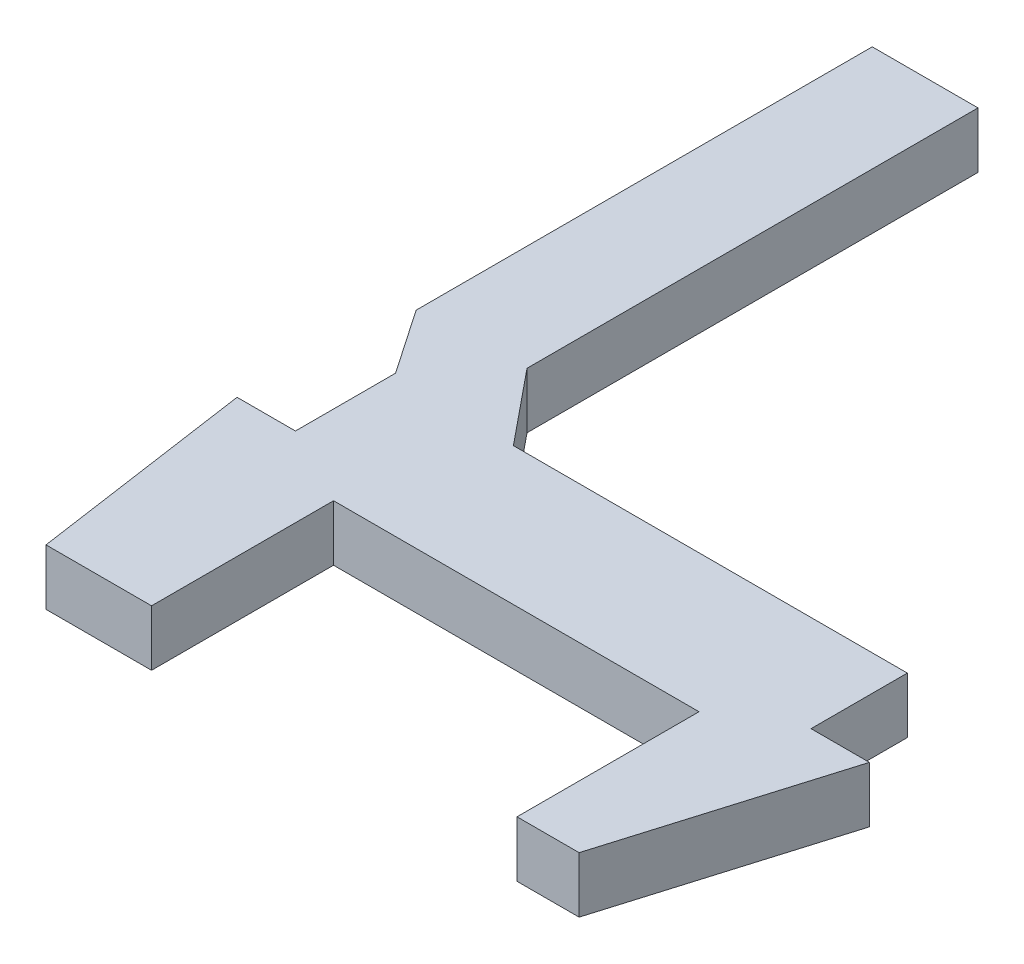
ISO-10303-21;
HEADER;
FILE_DESCRIPTION(('STEP AP214'),'2;1');
FILE_NAME('part.step','',(''),(''),'','','');
FILE_SCHEMA(('AUTOMOTIVE_DESIGN { 1 0 10303 214 1 1 1 1 }'));
ENDSEC;
DATA;
#1=APPLICATION_CONTEXT('core data for automotive mechanical design processes');
#2=APPLICATION_PROTOCOL_DEFINITION('international standard','automotive_design',2000,#1);
#3=PRODUCT_CONTEXT('',#1,'mechanical');
#4=PRODUCT('Part','Part','',(#3));
#5=PRODUCT_RELATED_PRODUCT_CATEGORY('part','',(#4));
#6=PRODUCT_DEFINITION_FORMATION('','',#4);
#7=PRODUCT_DEFINITION_CONTEXT('part definition',#1,'design');
#8=PRODUCT_DEFINITION('design','',#6,#7);
#9=PRODUCT_DEFINITION_SHAPE('','',#8);
#10=(LENGTH_UNIT() NAMED_UNIT(*) SI_UNIT(.MILLI.,.METRE.));
#11=(NAMED_UNIT(*) PLANE_ANGLE_UNIT() SI_UNIT($,.RADIAN.));
#12=(NAMED_UNIT(*) SI_UNIT($,.STERADIAN.) SOLID_ANGLE_UNIT());
#13=UNCERTAINTY_MEASURE_WITH_UNIT(LENGTH_MEASURE(1.E-05),#10,'distance_accuracy_value','');
#14=(GEOMETRIC_REPRESENTATION_CONTEXT(3) GLOBAL_UNCERTAINTY_ASSIGNED_CONTEXT((#13)) GLOBAL_UNIT_ASSIGNED_CONTEXT((#10,
#11,#12)) REPRESENTATION_CONTEXT('',''));
#15=CARTESIAN_POINT('',(0.,0.,0.));
#16=DIRECTION('',(0.,0.,1.));
#17=DIRECTION('',(1.,0.,0.));
#18=AXIS2_PLACEMENT_3D('',#15,#16,#17);
#19=CARTESIAN_POINT('',(-3.887220045903,-0.225,1.053796595231));
#20=DIRECTION('',(0.,-1.,0.));
#21=DIRECTION('',(0.,0.,-1.));
#22=AXIS2_PLACEMENT_3D('',#19,#20,#21);
#23=PLANE('',#22);
#24=DIRECTION('',(0.,0.,-1.));
#25=VECTOR('',#24,1.);
#26=CARTESIAN_POINT('',(-5.633558,-0.225,0.573115));
#27=LINE('',#26,#25);
#28=CARTESIAN_POINT('',(-5.633558,-0.225,0.573115));
#29=VERTEX_POINT('',#28);
#30=CARTESIAN_POINT('',(-5.633558,-0.225,-3.1));
#31=VERTEX_POINT('',#30);
#32=EDGE_CURVE('E212',#29,#31,#27,.T.);
#33=ORIENTED_EDGE('',*,*,#32,.T.);
#34=DIRECTION('',(1.,0.,0.));
#35=VECTOR('',#34,1.);
#36=CARTESIAN_POINT('',(-5.633558,-0.225,-3.1));
#37=LINE('',#36,#35);
#38=CARTESIAN_POINT('',(-4.781852,-0.225,-3.1));
#39=VERTEX_POINT('',#38);
#40=EDGE_CURVE('E202',#31,#39,#37,.T.);
#41=ORIENTED_EDGE('',*,*,#40,.T.);
#42=DIRECTION('',(0.,0.,1.));
#43=VECTOR('',#42,1.);
#44=CARTESIAN_POINT('',(-4.781852,-0.225,-3.1));
#45=LINE('',#44,#43);
#46=CARTESIAN_POINT('',(-4.781852,-0.225,0.531664));
#47=VERTEX_POINT('',#46);
#48=EDGE_CURVE('E294',#39,#47,#45,.T.);
#49=ORIENTED_EDGE('',*,*,#48,.T.);
#50=DIRECTION('',(0.632051189116861,0.,0.774926638034829));
#51=VECTOR('',#50,1.);
#52=CARTESIAN_POINT('',(-4.781852,-0.225,0.531664));
#53=LINE('',#52,#51);
#54=CARTESIAN_POINT('',(-4.297031,-0.225,1.126079));
#55=VERTEX_POINT('',#54);
#56=EDGE_CURVE('E194',#47,#55,#53,.T.);
#57=ORIENTED_EDGE('',*,*,#56,.T.);
#58=DIRECTION('',(1.,0.,0.));
#59=VECTOR('',#58,1.);
#60=CARTESIAN_POINT('',(-4.297031,-0.225,1.126079));
#61=LINE('',#60,#59);
#62=CARTESIAN_POINT('',(-1.124856,-0.225,1.126079));
#63=VERTEX_POINT('',#62);
#64=EDGE_CURVE('E229',#55,#63,#61,.T.);
#65=ORIENTED_EDGE('',*,*,#64,.T.);
#66=DIRECTION('',(0.,0.,1.));
#67=VECTOR('',#66,1.);
#68=CARTESIAN_POINT('',(-1.124856,-0.225,1.126079));
#69=LINE('',#68,#67);
#70=CARTESIAN_POINT('',(-1.124856,-0.225,1.901539999995));
#71=VERTEX_POINT('',#70);
#72=EDGE_CURVE('E20',#63,#71,#69,.T.);
#73=ORIENTED_EDGE('',*,*,#72,.T.);
#74=DIRECTION('',(1.,0.,0.));
#75=VECTOR('',#74,1.);
#76=CARTESIAN_POINT('',(-1.124856,-0.225,1.901539999995));
#77=LINE('',#76,#75);
#78=CARTESIAN_POINT('',(-0.654846,-0.225,1.901539999995));
#79=VERTEX_POINT('',#78);
#80=EDGE_CURVE('E295',#71,#79,#77,.T.);
#81=ORIENTED_EDGE('',*,*,#80,.T.);
#82=DIRECTION('',(-0.287164642261005,0.,0.957881239108016));
#83=VECTOR('',#82,1.);
#84=CARTESIAN_POINT('',(-0.654846,-0.225,1.901539999995));
#85=LINE('',#84,#83);
#86=CARTESIAN_POINT('',(-1.194009,-0.225,3.7));
#87=VERTEX_POINT('',#86);
#88=EDGE_CURVE('E218',#79,#87,#85,.T.);
#89=ORIENTED_EDGE('',*,*,#88,.T.);
#90=DIRECTION('',(-1.,0.,0.));
#91=VECTOR('',#90,1.);
#92=CARTESIAN_POINT('',(-1.194009,-0.225,3.7));
#93=LINE('',#92,#91);
#94=CARTESIAN_POINT('',(-1.694009,-0.225,3.7));
#95=VERTEX_POINT('',#94);
#96=EDGE_CURVE('E256',#87,#95,#93,.T.);
#97=ORIENTED_EDGE('',*,*,#96,.T.);
#98=DIRECTION('',(0.,0.,-1.));
#99=VECTOR('',#98,1.);
#100=CARTESIAN_POINT('',(-1.694009,-0.225,3.7));
#101=LINE('',#100,#99);
#102=CARTESIAN_POINT('',(-1.694009,-0.225,2.234428));
#103=VERTEX_POINT('',#102);
#104=EDGE_CURVE('E236',#95,#103,#101,.T.);
#105=ORIENTED_EDGE('',*,*,#104,.T.);
#106=DIRECTION('',(-1.,0.,0.));
#107=VECTOR('',#106,1.);
#108=CARTESIAN_POINT('',(-1.694009,-0.225,2.234428));
#109=LINE('',#108,#107);
#110=CARTESIAN_POINT('',(-4.637080321881,-0.225,2.234428));
#111=VERTEX_POINT('',#110);
#112=EDGE_CURVE('E251',#103,#111,#109,.T.);
#113=ORIENTED_EDGE('',*,*,#112,.T.);
#114=DIRECTION('',(0.,0.,1.));
#115=VECTOR('',#114,1.);
#116=CARTESIAN_POINT('',(-4.637080321881,-0.225,2.234428));
#117=LINE('',#116,#115);
#118=CARTESIAN_POINT('',(-4.637080321881,-0.225,3.7));
#119=VERTEX_POINT('',#118);
#120=EDGE_CURVE('E246',#111,#119,#117,.T.);
#121=ORIENTED_EDGE('',*,*,#120,.T.);
#122=DIRECTION('',(-1.,0.,0.));
#123=VECTOR('',#122,1.);
#124=CARTESIAN_POINT('',(-4.637080321881,-0.225,3.7));
#125=LINE('',#124,#123);
#126=CARTESIAN_POINT('',(-5.487080321881,-0.225,3.7));
#127=VERTEX_POINT('',#126);
#128=EDGE_CURVE('E261',#119,#127,#125,.T.);
#129=ORIENTED_EDGE('',*,*,#128,.T.);
#130=DIRECTION('',(-0.142975922708004,0.,-0.989726166940025));
#131=VECTOR('',#130,1.);
#132=CARTESIAN_POINT('',(-5.487080321881,-0.225,3.7));
#133=LINE('',#132,#131);
#134=CARTESIAN_POINT('',(-5.746886,-0.225,1.901539999995));
#135=VERTEX_POINT('',#134);
#136=EDGE_CURVE('E173',#127,#135,#133,.T.);
#137=ORIENTED_EDGE('',*,*,#136,.T.);
#138=DIRECTION('',(1.,0.,0.));
#139=VECTOR('',#138,1.);
#140=CARTESIAN_POINT('',(-5.746886,-0.225,1.901539999995));
#141=LINE('',#140,#139);
#142=CARTESIAN_POINT('',(-5.276876,-0.225,1.901539999995));
#143=VERTEX_POINT('',#142);
#144=EDGE_CURVE('E169',#135,#143,#141,.T.);
#145=ORIENTED_EDGE('',*,*,#144,.T.);
#146=DIRECTION('',(0.,0.,-1.));
#147=VECTOR('',#146,1.);
#148=CARTESIAN_POINT('',(-5.276876,-0.225,1.901539999995));
#149=LINE('',#148,#147);
#150=CARTESIAN_POINT('',(-5.276876,-0.225,1.094923));
#151=VERTEX_POINT('',#150);
#152=EDGE_CURVE('E156',#143,#151,#149,.T.);
#153=ORIENTED_EDGE('',*,*,#152,.T.);
#154=DIRECTION('',(-0.564312586386218,0.,-0.825561205996319));
#155=VECTOR('',#154,1.);
#156=CARTESIAN_POINT('',(-5.276876,-0.225,1.094923));
#157=LINE('',#156,#155);
#158=EDGE_CURVE('E11',#151,#29,#157,.T.);
#159=ORIENTED_EDGE('',*,*,#158,.T.);
#160=EDGE_LOOP('',(#33,#41,#49,#57,#65,#73,#81,#89,#97,#105,#113,#121,#129,#137,#145,#153,#159));
#161=FACE_BOUND('',#160,.T.);
#162=ADVANCED_FACE('F16',(#161),#23,.T.);
#163=CARTESIAN_POINT('',(-3.887220045903,0.225,1.053796595231));
#164=DIRECTION('',(0.,-1.,0.));
#165=DIRECTION('',(0.,0.,-1.));
#166=AXIS2_PLACEMENT_3D('',#163,#164,#165);
#167=PLANE('',#166);
#168=DIRECTION('',(-0.564312586386218,0.,-0.825561205996319));
#169=VECTOR('',#168,1.);
#170=CARTESIAN_POINT('',(-5.276876,0.225,1.094923));
#171=LINE('',#170,#169);
#172=CARTESIAN_POINT('',(-5.276876,0.225,1.094923));
#173=VERTEX_POINT('',#172);
#174=CARTESIAN_POINT('',(-5.633558,0.225,0.573115));
#175=VERTEX_POINT('',#174);
#176=EDGE_CURVE('E27',#173,#175,#171,.T.);
#177=ORIENTED_EDGE('',*,*,#176,.F.);
#178=DIRECTION('',(0.,0.,-1.));
#179=VECTOR('',#178,1.);
#180=CARTESIAN_POINT('',(-5.276876,0.225,1.901539999995));
#181=LINE('',#180,#179);
#182=CARTESIAN_POINT('',(-5.276876,0.225,1.901539999995));
#183=VERTEX_POINT('',#182);
#184=EDGE_CURVE('E178',#183,#173,#181,.T.);
#185=ORIENTED_EDGE('',*,*,#184,.F.);
#186=DIRECTION('',(1.,0.,0.));
#187=VECTOR('',#186,1.);
#188=CARTESIAN_POINT('',(-5.746886,0.225,1.901539999995));
#189=LINE('',#188,#187);
#190=CARTESIAN_POINT('',(-5.746886,0.225,1.901539999995));
#191=VERTEX_POINT('',#190);
#192=EDGE_CURVE('E182',#191,#183,#189,.T.);
#193=ORIENTED_EDGE('',*,*,#192,.F.);
#194=DIRECTION('',(-0.142975922708004,0.,-0.989726166940025));
#195=VECTOR('',#194,1.);
#196=CARTESIAN_POINT('',(-5.487080321881,0.225,3.7));
#197=LINE('',#196,#195);
#198=CARTESIAN_POINT('',(-5.487080321881,0.225,3.7));
#199=VERTEX_POINT('',#198);
#200=EDGE_CURVE('E283',#199,#191,#197,.T.);
#201=ORIENTED_EDGE('',*,*,#200,.F.);
#202=DIRECTION('',(-1.,0.,0.));
#203=VECTOR('',#202,1.);
#204=CARTESIAN_POINT('',(-4.637080321881,0.225,3.7));
#205=LINE('',#204,#203);
#206=CARTESIAN_POINT('',(-4.637080321881,0.225,3.7));
#207=VERTEX_POINT('',#206);
#208=EDGE_CURVE('E262',#207,#199,#205,.T.);
#209=ORIENTED_EDGE('',*,*,#208,.F.);
#210=DIRECTION('',(0.,0.,1.));
#211=VECTOR('',#210,1.);
#212=CARTESIAN_POINT('',(-4.637080321881,0.225,2.234428));
#213=LINE('',#212,#211);
#214=CARTESIAN_POINT('',(-4.637080321881,0.225,2.234428));
#215=VERTEX_POINT('',#214);
#216=EDGE_CURVE('E247',#215,#207,#213,.T.);
#217=ORIENTED_EDGE('',*,*,#216,.F.);
#218=DIRECTION('',(-1.,0.,0.));
#219=VECTOR('',#218,1.);
#220=CARTESIAN_POINT('',(-1.694009,0.225,2.234428));
#221=LINE('',#220,#219);
#222=CARTESIAN_POINT('',(-1.694009,0.225,2.234428));
#223=VERTEX_POINT('',#222);
#224=EDGE_CURVE('E240',#223,#215,#221,.T.);
#225=ORIENTED_EDGE('',*,*,#224,.F.);
#226=DIRECTION('',(0.,0.,-1.));
#227=VECTOR('',#226,1.);
#228=CARTESIAN_POINT('',(-1.694009,0.225,3.7));
#229=LINE('',#228,#227);
#230=CARTESIAN_POINT('',(-1.694009,0.225,3.7));
#231=VERTEX_POINT('',#230);
#232=EDGE_CURVE('E252',#231,#223,#229,.T.);
#233=ORIENTED_EDGE('',*,*,#232,.F.);
#234=DIRECTION('',(-1.,0.,0.));
#235=VECTOR('',#234,1.);
#236=CARTESIAN_POINT('',(-1.194009,0.225,3.7));
#237=LINE('',#236,#235);
#238=CARTESIAN_POINT('',(-1.194009,0.225,3.7));
#239=VERTEX_POINT('',#238);
#240=EDGE_CURVE('E276',#239,#231,#237,.T.);
#241=ORIENTED_EDGE('',*,*,#240,.F.);
#242=DIRECTION('',(-0.287164642261005,0.,0.957881239108016));
#243=VECTOR('',#242,1.);
#244=CARTESIAN_POINT('',(-0.654846,0.225,1.901539999995));
#245=LINE('',#244,#243);
#246=CARTESIAN_POINT('',(-0.654846,0.225,1.901539999995));
#247=VERTEX_POINT('',#246);
#248=EDGE_CURVE('E219',#247,#239,#245,.T.);
#249=ORIENTED_EDGE('',*,*,#248,.F.);
#250=DIRECTION('',(1.,0.,0.));
#251=VECTOR('',#250,1.);
#252=CARTESIAN_POINT('',(-1.124856,0.225,1.901539999995));
#253=LINE('',#252,#251);
#254=CARTESIAN_POINT('',(-1.124856,0.225,1.901539999995));
#255=VERTEX_POINT('',#254);
#256=EDGE_CURVE('E267',#255,#247,#253,.T.);
#257=ORIENTED_EDGE('',*,*,#256,.F.);
#258=DIRECTION('',(0.,0.,1.));
#259=VECTOR('',#258,1.);
#260=CARTESIAN_POINT('',(-1.124856,0.225,1.126079));
#261=LINE('',#260,#259);
#262=CARTESIAN_POINT('',(-1.124856,0.225,1.126079));
#263=VERTEX_POINT('',#262);
#264=EDGE_CURVE('E224',#263,#255,#261,.T.);
#265=ORIENTED_EDGE('',*,*,#264,.F.);
#266=DIRECTION('',(1.,0.,0.));
#267=VECTOR('',#266,1.);
#268=CARTESIAN_POINT('',(-4.297031,0.225,1.126079));
#269=LINE('',#268,#267);
#270=CARTESIAN_POINT('',(-4.297031,0.225,1.126079));
#271=VERTEX_POINT('',#270);
#272=EDGE_CURVE('E198',#271,#263,#269,.T.);
#273=ORIENTED_EDGE('',*,*,#272,.F.);
#274=DIRECTION('',(0.632051189116861,0.,0.774926638034829));
#275=VECTOR('',#274,1.);
#276=CARTESIAN_POINT('',(-4.781852,0.225,0.531664));
#277=LINE('',#276,#275);
#278=CARTESIAN_POINT('',(-4.781852,0.225,0.531664));
#279=VERTEX_POINT('',#278);
#280=EDGE_CURVE('E266',#279,#271,#277,.T.);
#281=ORIENTED_EDGE('',*,*,#280,.F.);
#282=DIRECTION('',(0.,0.,1.));
#283=VECTOR('',#282,1.);
#284=CARTESIAN_POINT('',(-4.781852,0.225,-3.1));
#285=LINE('',#284,#283);
#286=CARTESIAN_POINT('',(-4.781852,0.225,-3.1));
#287=VERTEX_POINT('',#286);
#288=EDGE_CURVE('E206',#287,#279,#285,.T.);
#289=ORIENTED_EDGE('',*,*,#288,.F.);
#290=DIRECTION('',(1.,0.,0.));
#291=VECTOR('',#290,1.);
#292=CARTESIAN_POINT('',(-5.633558,0.225,-3.1));
#293=LINE('',#292,#291);
#294=CARTESIAN_POINT('',(-5.633558,0.225,-3.1));
#295=VERTEX_POINT('',#294);
#296=EDGE_CURVE('E299',#295,#287,#293,.T.);
#297=ORIENTED_EDGE('',*,*,#296,.F.);
#298=DIRECTION('',(0.,0.,-1.));
#299=VECTOR('',#298,1.);
#300=CARTESIAN_POINT('',(-5.633558,0.225,0.573115));
#301=LINE('',#300,#299);
#302=EDGE_CURVE('E213',#175,#295,#301,.T.);
#303=ORIENTED_EDGE('',*,*,#302,.F.);
#304=EDGE_LOOP('',(#177,#185,#193,#201,#209,#217,#225,#233,#241,#249,#257,#265,#273,#281,#289,
#297,#303));
#305=FACE_BOUND('',#304,.T.);
#306=ADVANCED_FACE('F327',(#305),#167,.F.);
#307=CARTESIAN_POINT('',(-5.276876,0.225,1.094923));
#308=DIRECTION('',(0.825561205996319,0.,-0.564312586386218));
#309=DIRECTION('',(0.,-1.,0.));
#310=AXIS2_PLACEMENT_3D('',#307,#308,#309);
#311=PLANE('',#310);
#312=ORIENTED_EDGE('',*,*,#176,.T.);
#313=DIRECTION('',(0.,-1.,0.));
#314=VECTOR('',#313,1.);
#315=CARTESIAN_POINT('',(-5.633558,0.225,0.573115));
#316=LINE('',#315,#314);
#317=EDGE_CURVE('E235',#175,#29,#316,.T.);
#318=ORIENTED_EDGE('',*,*,#317,.T.);
#319=ORIENTED_EDGE('',*,*,#158,.F.);
#320=DIRECTION('',(0.,-1.,0.));
#321=VECTOR('',#320,1.);
#322=CARTESIAN_POINT('',(-5.276876,0.225,1.094923));
#323=LINE('',#322,#321);
#324=EDGE_CURVE('E163',#173,#151,#323,.T.);
#325=ORIENTED_EDGE('',*,*,#324,.F.);
#326=EDGE_LOOP('',(#312,#318,#319,#325));
#327=FACE_BOUND('',#326,.T.);
#328=ADVANCED_FACE('F18',(#327),#311,.F.);
#329=CARTESIAN_POINT('',(-5.276876,0.225,1.901539999995));
#330=DIRECTION('',(1.,0.,0.));
#331=DIRECTION('',(0.,1.,0.));
#332=AXIS2_PLACEMENT_3D('',#329,#330,#331);
#333=PLANE('',#332);
#334=ORIENTED_EDGE('',*,*,#184,.T.);
#335=ORIENTED_EDGE('',*,*,#324,.T.);
#336=ORIENTED_EDGE('',*,*,#152,.F.);
#337=DIRECTION('',(0.,-1.,0.));
#338=VECTOR('',#337,1.);
#339=CARTESIAN_POINT('',(-5.276876,0.225,1.901539999995));
#340=LINE('',#339,#338);
#341=EDGE_CURVE('E161',#183,#143,#340,.T.);
#342=ORIENTED_EDGE('',*,*,#341,.F.);
#343=EDGE_LOOP('',(#334,#335,#336,#342));
#344=FACE_BOUND('',#343,.T.);
#345=ADVANCED_FACE('F159',(#344),#333,.F.);
#346=CARTESIAN_POINT('',(-5.746886,0.225,1.901539999995));
#347=DIRECTION('',(0.,0.,1.));
#348=DIRECTION('',(0.,-1.,0.));
#349=AXIS2_PLACEMENT_3D('',#346,#347,#348);
#350=PLANE('',#349);
#351=ORIENTED_EDGE('',*,*,#192,.T.);
#352=ORIENTED_EDGE('',*,*,#341,.T.);
#353=ORIENTED_EDGE('',*,*,#144,.F.);
#354=DIRECTION('',(0.,-1.,0.));
#355=VECTOR('',#354,1.);
#356=CARTESIAN_POINT('',(-5.746886,0.225,1.901539999995));
#357=LINE('',#356,#355);
#358=EDGE_CURVE('E280',#191,#135,#357,.T.);
#359=ORIENTED_EDGE('',*,*,#358,.F.);
#360=EDGE_LOOP('',(#351,#352,#353,#359));
#361=FACE_BOUND('',#360,.T.);
#362=ADVANCED_FACE('F180',(#361),#350,.F.);
#363=CARTESIAN_POINT('',(-5.487080321881,0.225,3.7));
#364=DIRECTION('',(0.989726166940025,0.,-0.142975922708004));
#365=DIRECTION('',(0.,-1.,0.));
#366=AXIS2_PLACEMENT_3D('',#363,#364,#365);
#367=PLANE('',#366);
#368=ORIENTED_EDGE('',*,*,#200,.T.);
#369=ORIENTED_EDGE('',*,*,#358,.T.);
#370=ORIENTED_EDGE('',*,*,#136,.F.);
#371=DIRECTION('',(0.,-1.,0.));
#372=VECTOR('',#371,1.);
#373=CARTESIAN_POINT('',(-5.487080321881,0.225,3.7));
#374=LINE('',#373,#372);
#375=EDGE_CURVE('E257',#199,#127,#374,.T.);
#376=ORIENTED_EDGE('',*,*,#375,.F.);
#377=EDGE_LOOP('',(#368,#369,#370,#376));
#378=FACE_BOUND('',#377,.T.);
#379=ADVANCED_FACE('F353',(#378),#367,.F.);
#380=CARTESIAN_POINT('',(-4.637080321881,0.225,3.7));
#381=DIRECTION('',(0.,0.,-1.));
#382=DIRECTION('',(-1.,0.,0.));
#383=AXIS2_PLACEMENT_3D('',#380,#381,#382);
#384=PLANE('',#383);
#385=ORIENTED_EDGE('',*,*,#208,.T.);
#386=ORIENTED_EDGE('',*,*,#375,.T.);
#387=ORIENTED_EDGE('',*,*,#128,.F.);
#388=DIRECTION('',(0.,-1.,0.));
#389=VECTOR('',#388,1.);
#390=CARTESIAN_POINT('',(-4.637080321881,0.225,3.7));
#391=LINE('',#390,#389);
#392=EDGE_CURVE('E242',#207,#119,#391,.T.);
#393=ORIENTED_EDGE('',*,*,#392,.F.);
#394=EDGE_LOOP('',(#385,#386,#387,#393));
#395=FACE_BOUND('',#394,.T.);
#396=ADVANCED_FACE('F350',(#395),#384,.F.);
#397=CARTESIAN_POINT('',(-4.637080321881,0.225,2.234428));
#398=DIRECTION('',(-1.,0.,0.));
#399=DIRECTION('',(0.,0.,1.));
#400=AXIS2_PLACEMENT_3D('',#397,#398,#399);
#401=PLANE('',#400);
#402=ORIENTED_EDGE('',*,*,#216,.T.);
#403=ORIENTED_EDGE('',*,*,#392,.T.);
#404=ORIENTED_EDGE('',*,*,#120,.F.);
#405=DIRECTION('',(0.,-1.,0.));
#406=VECTOR('',#405,1.);
#407=CARTESIAN_POINT('',(-4.637080321881,0.225,2.234428));
#408=LINE('',#407,#406);
#409=EDGE_CURVE('E191',#215,#111,#408,.T.);
#410=ORIENTED_EDGE('',*,*,#409,.F.);
#411=EDGE_LOOP('',(#402,#403,#404,#410));
#412=FACE_BOUND('',#411,.T.);
#413=ADVANCED_FACE('F352',(#412),#401,.F.);
#414=CARTESIAN_POINT('',(-1.694009,0.225,2.234428));
#415=DIRECTION('',(0.,0.,-1.));
#416=DIRECTION('',(-1.,0.,0.));
#417=AXIS2_PLACEMENT_3D('',#414,#415,#416);
#418=PLANE('',#417);
#419=ORIENTED_EDGE('',*,*,#224,.T.);
#420=ORIENTED_EDGE('',*,*,#409,.T.);
#421=ORIENTED_EDGE('',*,*,#112,.F.);
#422=DIRECTION('',(0.,-1.,0.));
#423=VECTOR('',#422,1.);
#424=CARTESIAN_POINT('',(-1.694009,0.225,2.234428));
#425=LINE('',#424,#423);
#426=EDGE_CURVE('E241',#223,#103,#425,.T.);
#427=ORIENTED_EDGE('',*,*,#426,.F.);
#428=EDGE_LOOP('',(#419,#420,#421,#427));
#429=FACE_BOUND('',#428,.T.);
#430=ADVANCED_FACE('F359',(#429),#418,.F.);
#431=CARTESIAN_POINT('',(-1.694009,0.225,3.7));
#432=DIRECTION('',(1.,0.,0.));
#433=DIRECTION('',(0.,1.,0.));
#434=AXIS2_PLACEMENT_3D('',#431,#432,#433);
#435=PLANE('',#434);
#436=ORIENTED_EDGE('',*,*,#232,.T.);
#437=ORIENTED_EDGE('',*,*,#426,.T.);
#438=ORIENTED_EDGE('',*,*,#104,.F.);
#439=DIRECTION('',(0.,-1.,0.));
#440=VECTOR('',#439,1.);
#441=CARTESIAN_POINT('',(-1.694009,0.225,3.7));
#442=LINE('',#441,#440);
#443=EDGE_CURVE('E272',#231,#95,#442,.T.);
#444=ORIENTED_EDGE('',*,*,#443,.F.);
#445=EDGE_LOOP('',(#436,#437,#438,#444));
#446=FACE_BOUND('',#445,.T.);
#447=ADVANCED_FACE('F412',(#446),#435,.F.);
#448=CARTESIAN_POINT('',(-1.194009,0.225,3.7));
#449=DIRECTION('',(0.,0.,-1.));
#450=DIRECTION('',(-1.,0.,0.));
#451=AXIS2_PLACEMENT_3D('',#448,#449,#450);
#452=PLANE('',#451);
#453=ORIENTED_EDGE('',*,*,#240,.T.);
#454=ORIENTED_EDGE('',*,*,#443,.T.);
#455=ORIENTED_EDGE('',*,*,#96,.F.);
#456=DIRECTION('',(0.,-1.,0.));
#457=VECTOR('',#456,1.);
#458=CARTESIAN_POINT('',(-1.194009,0.225,3.7));
#459=LINE('',#458,#457);
#460=EDGE_CURVE('E214',#239,#87,#459,.T.);
#461=ORIENTED_EDGE('',*,*,#460,.F.);
#462=EDGE_LOOP('',(#453,#454,#455,#461));
#463=FACE_BOUND('',#462,.T.);
#464=ADVANCED_FACE('F407',(#463),#452,.F.);
#465=CARTESIAN_POINT('',(-0.654846,0.225,1.901539999995));
#466=DIRECTION('',(-0.957881239108016,0.,-0.287164642261005));
#467=DIRECTION('',(-0.287164642261005,0.,0.957881239108016));
#468=AXIS2_PLACEMENT_3D('',#465,#466,#467);
#469=PLANE('',#468);
#470=ORIENTED_EDGE('',*,*,#248,.T.);
#471=ORIENTED_EDGE('',*,*,#460,.T.);
#472=ORIENTED_EDGE('',*,*,#88,.F.);
#473=DIRECTION('',(0.,-1.,0.));
#474=VECTOR('',#473,1.);
#475=CARTESIAN_POINT('',(-0.654846,0.225,1.901539999995));
#476=LINE('',#475,#474);
#477=EDGE_CURVE('E271',#247,#79,#476,.T.);
#478=ORIENTED_EDGE('',*,*,#477,.F.);
#479=EDGE_LOOP('',(#470,#471,#472,#478));
#480=FACE_BOUND('',#479,.T.);
#481=ADVANCED_FACE('F415',(#480),#469,.F.);
#482=CARTESIAN_POINT('',(-1.124856,0.225,1.901539999995));
#483=DIRECTION('',(0.,0.,1.));
#484=DIRECTION('',(0.,-1.,0.));
#485=AXIS2_PLACEMENT_3D('',#482,#483,#484);
#486=PLANE('',#485);
#487=ORIENTED_EDGE('',*,*,#256,.T.);
#488=ORIENTED_EDGE('',*,*,#477,.T.);
#489=ORIENTED_EDGE('',*,*,#80,.F.);
#490=DIRECTION('',(0.,-1.,0.));
#491=VECTOR('',#490,1.);
#492=CARTESIAN_POINT('',(-1.124856,0.225,1.901539999995));
#493=LINE('',#492,#491);
#494=EDGE_CURVE('E228',#255,#71,#493,.T.);
#495=ORIENTED_EDGE('',*,*,#494,.F.);
#496=EDGE_LOOP('',(#487,#488,#489,#495));
#497=FACE_BOUND('',#496,.T.);
#498=ADVANCED_FACE('F419',(#497),#486,.F.);
#499=CARTESIAN_POINT('',(-1.124856,0.225,1.126079));
#500=DIRECTION('',(-1.,0.,0.));
#501=DIRECTION('',(0.,0.,1.));
#502=AXIS2_PLACEMENT_3D('',#499,#500,#501);
#503=PLANE('',#502);
#504=ORIENTED_EDGE('',*,*,#264,.T.);
#505=ORIENTED_EDGE('',*,*,#494,.T.);
#506=ORIENTED_EDGE('',*,*,#72,.F.);
#507=DIRECTION('',(0.,-1.,0.));
#508=VECTOR('',#507,1.);
#509=CARTESIAN_POINT('',(-1.124856,0.225,1.126079));
#510=LINE('',#509,#508);
#511=EDGE_CURVE('E223',#263,#63,#510,.T.);
#512=ORIENTED_EDGE('',*,*,#511,.F.);
#513=EDGE_LOOP('',(#504,#505,#506,#512));
#514=FACE_BOUND('',#513,.T.);
#515=ADVANCED_FACE('F424',(#514),#503,.F.);
#516=CARTESIAN_POINT('',(-4.297031,0.225,1.126079));
#517=DIRECTION('',(0.,0.,1.));
#518=DIRECTION('',(0.,-1.,0.));
#519=AXIS2_PLACEMENT_3D('',#516,#517,#518);
#520=PLANE('',#519);
#521=ORIENTED_EDGE('',*,*,#272,.T.);
#522=ORIENTED_EDGE('',*,*,#511,.T.);
#523=ORIENTED_EDGE('',*,*,#64,.F.);
#524=DIRECTION('',(0.,-1.,0.));
#525=VECTOR('',#524,1.);
#526=CARTESIAN_POINT('',(-4.297031,0.225,1.126079));
#527=LINE('',#526,#525);
#528=EDGE_CURVE('E199',#271,#55,#527,.T.);
#529=ORIENTED_EDGE('',*,*,#528,.F.);
#530=EDGE_LOOP('',(#521,#522,#523,#529));
#531=FACE_BOUND('',#530,.T.);
#532=ADVANCED_FACE('F426',(#531),#520,.F.);
#533=CARTESIAN_POINT('',(-4.781852,0.225,0.531664));
#534=DIRECTION('',(-0.774926638034829,0.,0.632051189116861));
#535=DIRECTION('',(0.,1.,0.));
#536=AXIS2_PLACEMENT_3D('',#533,#534,#535);
#537=PLANE('',#536);
#538=ORIENTED_EDGE('',*,*,#280,.T.);
#539=ORIENTED_EDGE('',*,*,#528,.T.);
#540=ORIENTED_EDGE('',*,*,#56,.F.);
#541=DIRECTION('',(0.,-1.,0.));
#542=VECTOR('',#541,1.);
#543=CARTESIAN_POINT('',(-4.781852,0.225,0.531664));
#544=LINE('',#543,#542);
#545=EDGE_CURVE('E290',#279,#47,#544,.T.);
#546=ORIENTED_EDGE('',*,*,#545,.F.);
#547=EDGE_LOOP('',(#538,#539,#540,#546));
#548=FACE_BOUND('',#547,.T.);
#549=ADVANCED_FACE('F429',(#548),#537,.F.);
#550=CARTESIAN_POINT('',(-4.781852,0.225,-3.1));
#551=DIRECTION('',(-1.,0.,0.));
#552=DIRECTION('',(0.,0.,1.));
#553=AXIS2_PLACEMENT_3D('',#550,#551,#552);
#554=PLANE('',#553);
#555=ORIENTED_EDGE('',*,*,#288,.T.);
#556=ORIENTED_EDGE('',*,*,#545,.T.);
#557=ORIENTED_EDGE('',*,*,#48,.F.);
#558=DIRECTION('',(0.,-1.,0.));
#559=VECTOR('',#558,1.);
#560=CARTESIAN_POINT('',(-4.781852,0.225,-3.1));
#561=LINE('',#560,#559);
#562=EDGE_CURVE('E207',#287,#39,#561,.T.);
#563=ORIENTED_EDGE('',*,*,#562,.F.);
#564=EDGE_LOOP('',(#555,#556,#557,#563));
#565=FACE_BOUND('',#564,.T.);
#566=ADVANCED_FACE('F433',(#565),#554,.F.);
#567=CARTESIAN_POINT('',(-5.633558,0.225,-3.1));
#568=DIRECTION('',(0.,0.,1.));
#569=DIRECTION('',(0.,-1.,0.));
#570=AXIS2_PLACEMENT_3D('',#567,#568,#569);
#571=PLANE('',#570);
#572=ORIENTED_EDGE('',*,*,#296,.T.);
#573=ORIENTED_EDGE('',*,*,#562,.T.);
#574=ORIENTED_EDGE('',*,*,#40,.F.);
#575=DIRECTION('',(0.,-1.,0.));
#576=VECTOR('',#575,1.);
#577=CARTESIAN_POINT('',(-5.633558,0.225,-3.1));
#578=LINE('',#577,#576);
#579=EDGE_CURVE('E208',#295,#31,#578,.T.);
#580=ORIENTED_EDGE('',*,*,#579,.F.);
#581=EDGE_LOOP('',(#572,#573,#574,#580));
#582=FACE_BOUND('',#581,.T.);
#583=ADVANCED_FACE('F348',(#582),#571,.F.);
#584=CARTESIAN_POINT('',(-5.633558,0.225,0.573115));
#585=DIRECTION('',(1.,0.,0.));
#586=DIRECTION('',(0.,1.,0.));
#587=AXIS2_PLACEMENT_3D('',#584,#585,#586);
#588=PLANE('',#587);
#589=ORIENTED_EDGE('',*,*,#302,.T.);
#590=ORIENTED_EDGE('',*,*,#579,.T.);
#591=ORIENTED_EDGE('',*,*,#32,.F.);
#592=ORIENTED_EDGE('',*,*,#317,.F.);
#593=EDGE_LOOP('',(#589,#590,#591,#592));
#594=FACE_BOUND('',#593,.T.);
#595=ADVANCED_FACE('F346',(#594),#588,.F.);
#596=CLOSED_SHELL('',(#162,#306,#328,#345,#362,#379,#396,#413,#430,#447,#464,#481,#498,#515,
#532,#549,#566,#583,#595));
#597=MANIFOLD_SOLID_BREP('B1',#596);
#598=ADVANCED_BREP_SHAPE_REPRESENTATION('',(#18,#597),#14);
#599=SHAPE_DEFINITION_REPRESENTATION(#9,#598);
ENDSEC;
END-ISO-10303-21;
